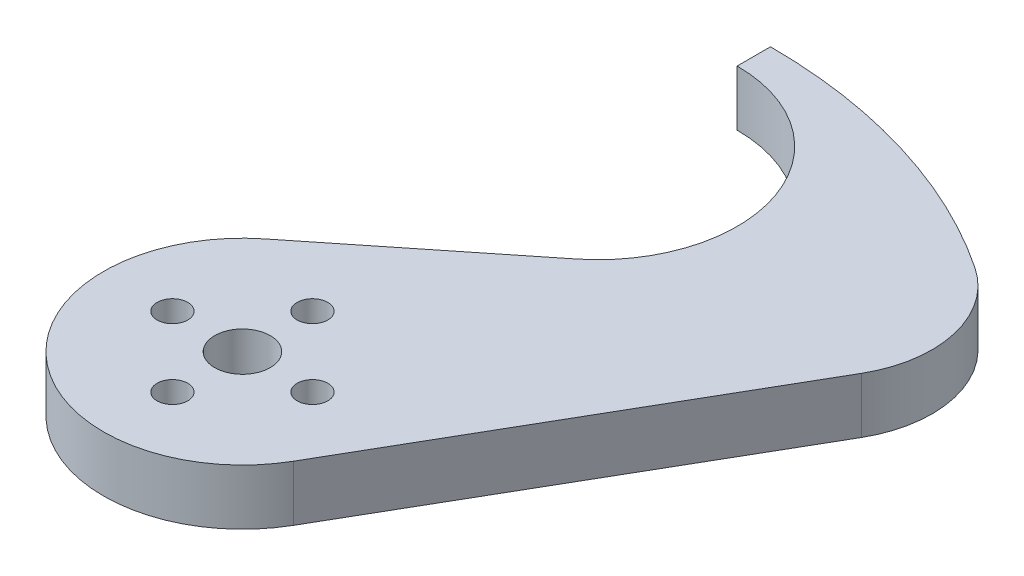
ISO-10303-21;
HEADER;
FILE_DESCRIPTION(('STEP AP214'),'2;1');
FILE_NAME('part.step','',(''),(''),'','','');
FILE_SCHEMA(('AUTOMOTIVE_DESIGN { 1 0 10303 214 1 1 1 1 }'));
ENDSEC;
DATA;
#1=APPLICATION_CONTEXT('core data for automotive mechanical design processes');
#2=APPLICATION_PROTOCOL_DEFINITION('international standard','automotive_design',2000,#1);
#3=PRODUCT_CONTEXT('',#1,'mechanical');
#4=PRODUCT('Part','Part','',(#3));
#5=PRODUCT_RELATED_PRODUCT_CATEGORY('part','',(#4));
#6=PRODUCT_DEFINITION_FORMATION('','',#4);
#7=PRODUCT_DEFINITION_CONTEXT('part definition',#1,'design');
#8=PRODUCT_DEFINITION('design','',#6,#7);
#9=PRODUCT_DEFINITION_SHAPE('','',#8);
#10=(LENGTH_UNIT() NAMED_UNIT(*) SI_UNIT(.MILLI.,.METRE.));
#11=(NAMED_UNIT(*) PLANE_ANGLE_UNIT() SI_UNIT($,.RADIAN.));
#12=(NAMED_UNIT(*) SI_UNIT($,.STERADIAN.) SOLID_ANGLE_UNIT());
#13=UNCERTAINTY_MEASURE_WITH_UNIT(LENGTH_MEASURE(1.E-05),#10,'distance_accuracy_value','');
#14=(GEOMETRIC_REPRESENTATION_CONTEXT(3) GLOBAL_UNCERTAINTY_ASSIGNED_CONTEXT((#13)) GLOBAL_UNIT_ASSIGNED_CONTEXT((#10,
#11,#12)) REPRESENTATION_CONTEXT('',''));
#15=CARTESIAN_POINT('',(0.,0.,0.));
#16=DIRECTION('',(0.,0.,1.));
#17=DIRECTION('',(1.,0.,0.));
#18=AXIS2_PLACEMENT_3D('',#15,#16,#17);
#19=CARTESIAN_POINT('',(0.,6.35,0.));
#20=DIRECTION('',(0.,-1.,0.));
#21=DIRECTION('',(0.,0.,-1.));
#22=AXIS2_PLACEMENT_3D('',#19,#20,#21);
#23=PLANE('',#22);
#24=CARTESIAN_POINT('',(0.,6.35,-8.));
#25=DIRECTION('',(0.,1.,0.));
#26=DIRECTION('',(1.,0.,0.));
#27=AXIS2_PLACEMENT_3D('',#24,#25,#26);
#28=CIRCLE('',#27,1.75);
#29=CARTESIAN_POINT('',(1.75000000000008,6.35,-7.99999999999998));
#30=VERTEX_POINT('',#29);
#31=EDGE_CURVE('E171',#30,#30,#28,.T.);
#32=ORIENTED_EDGE('',*,*,#31,.F.);
#33=EDGE_LOOP('',(#32));
#34=FACE_BOUND('',#33,.T.);
#35=CARTESIAN_POINT('',(-8.,6.35,0.));
#36=DIRECTION('',(0.,1.,0.));
#37=DIRECTION('',(0.,0.,-1.));
#38=AXIS2_PLACEMENT_3D('',#35,#36,#37);
#39=CIRCLE('',#38,1.75);
#40=CARTESIAN_POINT('',(-8.,6.35,-1.75));
#41=VERTEX_POINT('',#40);
#42=EDGE_CURVE('E165',#41,#41,#39,.T.);
#43=ORIENTED_EDGE('',*,*,#42,.F.);
#44=EDGE_LOOP('',(#43));
#45=FACE_BOUND('',#44,.T.);
#46=CARTESIAN_POINT('',(0.,6.35,8.));
#47=DIRECTION('',(0.,1.,0.));
#48=DIRECTION('',(-1.,0.,0.));
#49=AXIS2_PLACEMENT_3D('',#46,#47,#48);
#50=CIRCLE('',#49,1.75);
#51=CARTESIAN_POINT('',(-1.75000000000003,6.35,7.99999999999999));
#52=VERTEX_POINT('',#51);
#53=EDGE_CURVE('E159',#52,#52,#50,.T.);
#54=ORIENTED_EDGE('',*,*,#53,.F.);
#55=EDGE_LOOP('',(#54));
#56=FACE_BOUND('',#55,.T.);
#57=CARTESIAN_POINT('',(8.,6.35,0.));
#58=DIRECTION('',(0.,1.,0.));
#59=DIRECTION('',(0.,0.,1.));
#60=AXIS2_PLACEMENT_3D('',#57,#58,#59);
#61=CIRCLE('',#60,1.75);
#62=CARTESIAN_POINT('',(8.,6.35,1.75));
#63=VERTEX_POINT('',#62);
#64=EDGE_CURVE('E153',#63,#63,#61,.T.);
#65=ORIENTED_EDGE('',*,*,#64,.F.);
#66=EDGE_LOOP('',(#65));
#67=FACE_BOUND('',#66,.T.);
#68=DIRECTION('',(0.499999999999995,0.,-0.866025403784442));
#69=VECTOR('',#68,1.);
#70=CARTESIAN_POINT('',(13.748153285078,6.35,7.93749999999991));
#71=LINE('',#70,#69);
#72=CARTESIAN_POINT('',(13.748153285078,6.35,7.93749999999992));
#73=VERTEX_POINT('',#72);
#74=CARTESIAN_POINT('',(37.5076776910923,6.35,-33.2152034348901));
#75=VERTEX_POINT('',#74);
#76=EDGE_CURVE('E129',#73,#75,#71,.T.);
#77=ORIENTED_EDGE('',*,*,#76,.T.);
#78=CARTESIAN_POINT('',(26.5091550630299,6.35,-39.5652034348901));
#79=DIRECTION('',(0.,-1.,0.));
#80=DIRECTION('',(0.,0.,-1.));
#81=AXIS2_PLACEMENT_3D('',#78,#79,#80);
#82=CIRCLE('',#81,12.7);
#83=CARTESIAN_POINT('',(33.5782630798378,6.35,-50.1159243508608));
#84=VERTEX_POINT('',#83);
#85=EDGE_CURVE('E11',#75,#84,#82,.F.);
#86=ORIENTED_EDGE('',*,*,#85,.T.);
#87=CARTESIAN_POINT('',(0.,6.35,0.));
#88=DIRECTION('',(0.,1.,0.));
#89=DIRECTION('',(0.,0.,-1.));
#90=AXIS2_PLACEMENT_3D('',#87,#88,#89);
#91=CIRCLE('',#90,60.325);
#92=CARTESIAN_POINT('',(0.,6.35,-60.325));
#93=VERTEX_POINT('',#92);
#94=EDGE_CURVE('E90',#84,#93,#91,.T.);
#95=ORIENTED_EDGE('',*,*,#94,.T.);
#96=DIRECTION('',(0.,0.,1.));
#97=VECTOR('',#96,1.);
#98=CARTESIAN_POINT('',(0.,6.35,-60.325));
#99=LINE('',#98,#97);
#100=CARTESIAN_POINT('',(0.,6.35,-56.515));
#101=VERTEX_POINT('',#100);
#102=EDGE_CURVE('E93',#93,#101,#99,.T.);
#103=ORIENTED_EDGE('',*,*,#102,.T.);
#104=CARTESIAN_POINT('',(0.,6.35,-40.64));
#105=DIRECTION('',(0.,-1.,0.));
#106=DIRECTION('',(0.,0.,-1.));
#107=AXIS2_PLACEMENT_3D('',#104,#105,#106);
#108=CIRCLE('',#107,15.875);
#109=CARTESIAN_POINT('',(9.90946489508066,6.35,-28.23765625));
#110=VERTEX_POINT('',#109);
#111=EDGE_CURVE('E109',#101,#110,#108,.T.);
#112=ORIENTED_EDGE('',*,*,#111,.T.);
#113=DIRECTION('',(-0.78125,0.,0.624218261107443));
#114=VECTOR('',#113,1.);
#115=CARTESIAN_POINT('',(9.90946489508066,6.35,-28.23765625));
#116=LINE('',#115,#114);
#117=CARTESIAN_POINT('',(-9.90946489508066,6.35,-12.40234375));
#118=VERTEX_POINT('',#117);
#119=EDGE_CURVE('E144',#110,#118,#116,.T.);
#120=ORIENTED_EDGE('',*,*,#119,.T.);
#121=CARTESIAN_POINT('',(0.,6.35,0.));
#122=DIRECTION('',(0.,1.,0.));
#123=DIRECTION('',(0.,0.,1.));
#124=AXIS2_PLACEMENT_3D('',#121,#122,#123);
#125=CIRCLE('',#124,15.875);
#126=EDGE_CURVE('E142',#118,#73,#125,.T.);
#127=ORIENTED_EDGE('',*,*,#126,.T.);
#128=EDGE_LOOP('',(#77,#86,#95,#103,#112,#120,#127));
#129=FACE_BOUND('',#128,.T.);
#130=CARTESIAN_POINT('',(0.,6.35,0.));
#131=DIRECTION('',(0.,1.,0.));
#132=DIRECTION('',(0.,0.,1.));
#133=AXIS2_PLACEMENT_3D('',#130,#131,#132);
#134=CIRCLE('',#133,3.175);
#135=CARTESIAN_POINT('',(0.,6.35,3.175));
#136=VERTEX_POINT('',#135);
#137=EDGE_CURVE('E140',#136,#136,#134,.T.);
#138=ORIENTED_EDGE('',*,*,#137,.F.);
#139=EDGE_LOOP('',(#138));
#140=FACE_BOUND('',#139,.T.);
#141=ADVANCED_FACE('F32',(#34,#45,#56,#67,#129,#140),#23,.F.);
#142=CARTESIAN_POINT('',(0.,0.,0.));
#143=DIRECTION('',(0.,-1.,0.));
#144=DIRECTION('',(0.,0.,-1.));
#145=AXIS2_PLACEMENT_3D('',#142,#143,#144);
#146=PLANE('',#145);
#147=CARTESIAN_POINT('',(0.,0.,-8.));
#148=DIRECTION('',(0.,1.,0.));
#149=DIRECTION('',(1.,0.,0.));
#150=AXIS2_PLACEMENT_3D('',#147,#148,#149);
#151=CIRCLE('',#150,1.75);
#152=CARTESIAN_POINT('',(1.75000000000008,0.,-7.99999999999998));
#153=VERTEX_POINT('',#152);
#154=EDGE_CURVE('E168',#153,#153,#151,.T.);
#155=ORIENTED_EDGE('',*,*,#154,.T.);
#156=EDGE_LOOP('',(#155));
#157=FACE_BOUND('',#156,.T.);
#158=CARTESIAN_POINT('',(-8.,0.,0.));
#159=DIRECTION('',(0.,1.,0.));
#160=DIRECTION('',(0.,0.,-1.));
#161=AXIS2_PLACEMENT_3D('',#158,#159,#160);
#162=CIRCLE('',#161,1.75);
#163=CARTESIAN_POINT('',(-8.,0.,-1.75));
#164=VERTEX_POINT('',#163);
#165=EDGE_CURVE('E162',#164,#164,#162,.T.);
#166=ORIENTED_EDGE('',*,*,#165,.T.);
#167=EDGE_LOOP('',(#166));
#168=FACE_BOUND('',#167,.T.);
#169=CARTESIAN_POINT('',(0.,0.,8.));
#170=DIRECTION('',(0.,1.,0.));
#171=DIRECTION('',(-1.,0.,0.));
#172=AXIS2_PLACEMENT_3D('',#169,#170,#171);
#173=CIRCLE('',#172,1.75);
#174=CARTESIAN_POINT('',(-1.75000000000003,0.,7.99999999999999));
#175=VERTEX_POINT('',#174);
#176=EDGE_CURVE('E156',#175,#175,#173,.T.);
#177=ORIENTED_EDGE('',*,*,#176,.T.);
#178=EDGE_LOOP('',(#177));
#179=FACE_BOUND('',#178,.T.);
#180=CARTESIAN_POINT('',(8.,0.,0.));
#181=DIRECTION('',(0.,1.,0.));
#182=DIRECTION('',(0.,0.,1.));
#183=AXIS2_PLACEMENT_3D('',#180,#181,#182);
#184=CIRCLE('',#183,1.75);
#185=CARTESIAN_POINT('',(8.,0.,1.75));
#186=VERTEX_POINT('',#185);
#187=EDGE_CURVE('E150',#186,#186,#184,.T.);
#188=ORIENTED_EDGE('',*,*,#187,.T.);
#189=EDGE_LOOP('',(#188));
#190=FACE_BOUND('',#189,.T.);
#191=CARTESIAN_POINT('',(0.,0.,0.));
#192=DIRECTION('',(0.,1.,0.));
#193=DIRECTION('',(0.,0.,-1.));
#194=AXIS2_PLACEMENT_3D('',#191,#192,#193);
#195=CIRCLE('',#194,60.325);
#196=CARTESIAN_POINT('',(33.5782630798378,0.,-50.1159243508608));
#197=VERTEX_POINT('',#196);
#198=CARTESIAN_POINT('',(0.,0.,-60.325));
#199=VERTEX_POINT('',#198);
#200=EDGE_CURVE('E112',#197,#199,#195,.T.);
#201=ORIENTED_EDGE('',*,*,#200,.F.);
#202=CARTESIAN_POINT('',(26.5091550630299,0.,-39.5652034348901));
#203=DIRECTION('',(0.,-1.,0.));
#204=DIRECTION('',(0.,0.,-1.));
#205=AXIS2_PLACEMENT_3D('',#202,#203,#204);
#206=CIRCLE('',#205,12.7);
#207=CARTESIAN_POINT('',(37.5076776910923,0.,-33.2152034348901));
#208=VERTEX_POINT('',#207);
#209=EDGE_CURVE('E54',#197,#208,#206,.T.);
#210=ORIENTED_EDGE('',*,*,#209,.T.);
#211=DIRECTION('',(0.499999999999995,0.,-0.866025403784442));
#212=VECTOR('',#211,1.);
#213=CARTESIAN_POINT('',(13.748153285078,0.,7.93749999999991));
#214=LINE('',#213,#212);
#215=CARTESIAN_POINT('',(13.748153285078,0.,7.93749999999992));
#216=VERTEX_POINT('',#215);
#217=EDGE_CURVE('E100',#216,#208,#214,.T.);
#218=ORIENTED_EDGE('',*,*,#217,.F.);
#219=CARTESIAN_POINT('',(0.,0.,0.));
#220=DIRECTION('',(0.,1.,0.));
#221=DIRECTION('',(0.,0.,1.));
#222=AXIS2_PLACEMENT_3D('',#219,#220,#221);
#223=CIRCLE('',#222,15.875);
#224=CARTESIAN_POINT('',(-9.90946489508066,0.,-12.40234375));
#225=VERTEX_POINT('',#224);
#226=EDGE_CURVE('E131',#225,#216,#223,.T.);
#227=ORIENTED_EDGE('',*,*,#226,.F.);
#228=DIRECTION('',(-0.78125,0.,0.624218261107443));
#229=VECTOR('',#228,1.);
#230=CARTESIAN_POINT('',(9.90946489508066,0.,-28.23765625));
#231=LINE('',#230,#229);
#232=CARTESIAN_POINT('',(9.90946489508066,0.,-28.23765625));
#233=VERTEX_POINT('',#232);
#234=EDGE_CURVE('E133',#233,#225,#231,.T.);
#235=ORIENTED_EDGE('',*,*,#234,.F.);
#236=CARTESIAN_POINT('',(0.,0.,-40.64));
#237=DIRECTION('',(0.,-1.,0.));
#238=DIRECTION('',(0.,0.,-1.));
#239=AXIS2_PLACEMENT_3D('',#236,#237,#238);
#240=CIRCLE('',#239,15.875);
#241=CARTESIAN_POINT('',(0.,0.,-56.515));
#242=VERTEX_POINT('',#241);
#243=EDGE_CURVE('E135',#242,#233,#240,.T.);
#244=ORIENTED_EDGE('',*,*,#243,.F.);
#245=DIRECTION('',(0.,0.,1.));
#246=VECTOR('',#245,1.);
#247=CARTESIAN_POINT('',(0.,0.,-60.325));
#248=LINE('',#247,#246);
#249=EDGE_CURVE('E137',#199,#242,#248,.T.);
#250=ORIENTED_EDGE('',*,*,#249,.F.);
#251=EDGE_LOOP('',(#201,#210,#218,#227,#235,#244,#250));
#252=FACE_BOUND('',#251,.T.);
#253=CARTESIAN_POINT('',(0.,0.,0.));
#254=DIRECTION('',(0.,1.,0.));
#255=DIRECTION('',(0.,0.,1.));
#256=AXIS2_PLACEMENT_3D('',#253,#254,#255);
#257=CIRCLE('',#256,3.175);
#258=CARTESIAN_POINT('',(0.,0.,3.175));
#259=VERTEX_POINT('',#258);
#260=EDGE_CURVE('E147',#259,#259,#257,.T.);
#261=ORIENTED_EDGE('',*,*,#260,.T.);
#262=EDGE_LOOP('',(#261));
#263=FACE_BOUND('',#262,.T.);
#264=ADVANCED_FACE('F177',(#157,#168,#179,#190,#252,#263),#146,.T.);
#265=CARTESIAN_POINT('',(0.,6.35,0.));
#266=DIRECTION('',(0.,-1.,0.));
#267=DIRECTION('',(0.,0.,-1.));
#268=AXIS2_PLACEMENT_3D('',#265,#266,#267);
#269=CYLINDRICAL_SURFACE('',#268,60.325);
#270=ORIENTED_EDGE('',*,*,#94,.F.);
#271=DIRECTION('',(0.,-1.,0.));
#272=VECTOR('',#271,1.);
#273=CARTESIAN_POINT('',(33.5782630798378,6.35,-50.1159243508608));
#274=LINE('',#273,#272);
#275=EDGE_CURVE('E114',#84,#197,#274,.T.);
#276=ORIENTED_EDGE('',*,*,#275,.T.);
#277=ORIENTED_EDGE('',*,*,#200,.T.);
#278=DIRECTION('',(0.,-1.,0.));
#279=VECTOR('',#278,1.);
#280=CARTESIAN_POINT('',(0.,6.35,-60.325));
#281=LINE('',#280,#279);
#282=EDGE_CURVE('E105',#93,#199,#281,.T.);
#283=ORIENTED_EDGE('',*,*,#282,.F.);
#284=EDGE_LOOP('',(#270,#276,#277,#283));
#285=FACE_BOUND('',#284,.T.);
#286=ADVANCED_FACE('F111',(#285),#269,.T.);
#287=CARTESIAN_POINT('',(0.,6.35,-60.325));
#288=DIRECTION('',(1.,0.,0.));
#289=DIRECTION('',(0.,0.,-1.));
#290=AXIS2_PLACEMENT_3D('',#287,#288,#289);
#291=PLANE('',#290);
#292=ORIENTED_EDGE('',*,*,#249,.T.);
#293=DIRECTION('',(0.,-1.,0.));
#294=VECTOR('',#293,1.);
#295=CARTESIAN_POINT('',(0.,6.35,-56.515));
#296=LINE('',#295,#294);
#297=EDGE_CURVE('E107',#101,#242,#296,.T.);
#298=ORIENTED_EDGE('',*,*,#297,.F.);
#299=ORIENTED_EDGE('',*,*,#102,.F.);
#300=ORIENTED_EDGE('',*,*,#282,.T.);
#301=EDGE_LOOP('',(#292,#298,#299,#300));
#302=FACE_BOUND('',#301,.T.);
#303=ADVANCED_FACE('F104',(#302),#291,.F.);
#304=CARTESIAN_POINT('',(0.,6.35,-40.64));
#305=DIRECTION('',(0.,-1.,0.));
#306=DIRECTION('',(0.,0.,-1.));
#307=AXIS2_PLACEMENT_3D('',#304,#305,#306);
#308=CYLINDRICAL_SURFACE('',#307,15.875);
#309=ORIENTED_EDGE('',*,*,#243,.T.);
#310=DIRECTION('',(0.,-1.,0.));
#311=VECTOR('',#310,1.);
#312=CARTESIAN_POINT('',(9.90946489508066,6.35,-28.23765625));
#313=LINE('',#312,#311);
#314=EDGE_CURVE('E117',#110,#233,#313,.T.);
#315=ORIENTED_EDGE('',*,*,#314,.F.);
#316=ORIENTED_EDGE('',*,*,#111,.F.);
#317=ORIENTED_EDGE('',*,*,#297,.T.);
#318=EDGE_LOOP('',(#309,#315,#316,#317));
#319=FACE_BOUND('',#318,.T.);
#320=ADVANCED_FACE('F225',(#319),#308,.F.);
#321=CARTESIAN_POINT('',(9.90946489508066,6.35,-28.23765625));
#322=DIRECTION('',(0.624218261107443,0.,0.78125));
#323=DIRECTION('',(0.78125,0.,-0.624218261107443));
#324=AXIS2_PLACEMENT_3D('',#321,#322,#323);
#325=PLANE('',#324);
#326=ORIENTED_EDGE('',*,*,#234,.T.);
#327=DIRECTION('',(0.,-1.,0.));
#328=VECTOR('',#327,1.);
#329=CARTESIAN_POINT('',(-9.90946489508066,6.35,-12.40234375));
#330=LINE('',#329,#328);
#331=EDGE_CURVE('E123',#118,#225,#330,.T.);
#332=ORIENTED_EDGE('',*,*,#331,.F.);
#333=ORIENTED_EDGE('',*,*,#119,.F.);
#334=ORIENTED_EDGE('',*,*,#314,.T.);
#335=EDGE_LOOP('',(#326,#332,#333,#334));
#336=FACE_BOUND('',#335,.T.);
#337=ADVANCED_FACE('F221',(#336),#325,.F.);
#338=CARTESIAN_POINT('',(0.,6.35,0.));
#339=DIRECTION('',(0.,-1.,0.));
#340=DIRECTION('',(0.,0.,-1.));
#341=AXIS2_PLACEMENT_3D('',#338,#339,#340);
#342=CYLINDRICAL_SURFACE('',#341,15.875);
#343=ORIENTED_EDGE('',*,*,#226,.T.);
#344=DIRECTION('',(0.,-1.,0.));
#345=VECTOR('',#344,1.);
#346=CARTESIAN_POINT('',(13.748153285078,6.35,7.93749999999992));
#347=LINE('',#346,#345);
#348=EDGE_CURVE('E126',#73,#216,#347,.T.);
#349=ORIENTED_EDGE('',*,*,#348,.F.);
#350=ORIENTED_EDGE('',*,*,#126,.F.);
#351=ORIENTED_EDGE('',*,*,#331,.T.);
#352=EDGE_LOOP('',(#343,#349,#350,#351));
#353=FACE_BOUND('',#352,.T.);
#354=ADVANCED_FACE('F218',(#353),#342,.T.);
#355=CARTESIAN_POINT('',(13.748153285078,6.35,7.93749999999991));
#356=DIRECTION('',(-0.866025403784442,0.,-0.499999999999995));
#357=DIRECTION('',(-0.499999999999995,0.,0.866025403784442));
#358=AXIS2_PLACEMENT_3D('',#355,#356,#357);
#359=PLANE('',#358);
#360=ORIENTED_EDGE('',*,*,#217,.T.);
#361=DIRECTION('',(0.,-1.,0.));
#362=VECTOR('',#361,1.);
#363=CARTESIAN_POINT('',(37.5076776910923,6.35,-33.2152034348901));
#364=LINE('',#363,#362);
#365=EDGE_CURVE('E40',#208,#75,#364,.F.);
#366=ORIENTED_EDGE('',*,*,#365,.T.);
#367=ORIENTED_EDGE('',*,*,#76,.F.);
#368=ORIENTED_EDGE('',*,*,#348,.T.);
#369=EDGE_LOOP('',(#360,#366,#367,#368));
#370=FACE_BOUND('',#369,.T.);
#371=ADVANCED_FACE('F208',(#370),#359,.F.);
#372=CARTESIAN_POINT('',(0.,6.35,0.));
#373=DIRECTION('',(0.,-1.,0.));
#374=DIRECTION('',(0.,0.,-1.));
#375=AXIS2_PLACEMENT_3D('',#372,#373,#374);
#376=CYLINDRICAL_SURFACE('',#375,3.175);
#377=ORIENTED_EDGE('',*,*,#137,.T.);
#378=EDGE_LOOP('',(#377));
#379=FACE_BOUND('',#378,.T.);
#380=ORIENTED_EDGE('',*,*,#260,.F.);
#381=EDGE_LOOP('',(#380));
#382=FACE_BOUND('',#381,.T.);
#383=ADVANCED_FACE('F199',(#379,#382),#376,.F.);
#384=CARTESIAN_POINT('',(8.,0.,0.));
#385=DIRECTION('',(0.,1.,0.));
#386=DIRECTION('',(0.,0.,1.));
#387=AXIS2_PLACEMENT_3D('',#384,#385,#386);
#388=CYLINDRICAL_SURFACE('',#387,1.75);
#389=ORIENTED_EDGE('',*,*,#187,.F.);
#390=EDGE_LOOP('',(#389));
#391=FACE_BOUND('',#390,.T.);
#392=ORIENTED_EDGE('',*,*,#64,.T.);
#393=EDGE_LOOP('',(#392));
#394=FACE_BOUND('',#393,.T.);
#395=ADVANCED_FACE('F196',(#391,#394),#388,.F.);
#396=CARTESIAN_POINT('',(0.,0.,8.));
#397=DIRECTION('',(0.,1.,0.));
#398=DIRECTION('',(0.,0.,1.));
#399=AXIS2_PLACEMENT_3D('',#396,#397,#398);
#400=CYLINDRICAL_SURFACE('',#399,1.75);
#401=ORIENTED_EDGE('',*,*,#176,.F.);
#402=EDGE_LOOP('',(#401));
#403=FACE_BOUND('',#402,.T.);
#404=ORIENTED_EDGE('',*,*,#53,.T.);
#405=EDGE_LOOP('',(#404));
#406=FACE_BOUND('',#405,.T.);
#407=ADVANCED_FACE('F198',(#403,#406),#400,.F.);
#408=CARTESIAN_POINT('',(-8.,0.,0.));
#409=DIRECTION('',(0.,1.,0.));
#410=DIRECTION('',(0.,0.,1.));
#411=AXIS2_PLACEMENT_3D('',#408,#409,#410);
#412=CYLINDRICAL_SURFACE('',#411,1.75);
#413=ORIENTED_EDGE('',*,*,#165,.F.);
#414=EDGE_LOOP('',(#413));
#415=FACE_BOUND('',#414,.T.);
#416=ORIENTED_EDGE('',*,*,#42,.T.);
#417=EDGE_LOOP('',(#416));
#418=FACE_BOUND('',#417,.T.);
#419=ADVANCED_FACE('F183',(#415,#418),#412,.F.);
#420=CARTESIAN_POINT('',(0.,0.,-8.));
#421=DIRECTION('',(0.,1.,0.));
#422=DIRECTION('',(0.,0.,1.));
#423=AXIS2_PLACEMENT_3D('',#420,#421,#422);
#424=CYLINDRICAL_SURFACE('',#423,1.75);
#425=ORIENTED_EDGE('',*,*,#154,.F.);
#426=EDGE_LOOP('',(#425));
#427=FACE_BOUND('',#426,.T.);
#428=ORIENTED_EDGE('',*,*,#31,.T.);
#429=EDGE_LOOP('',(#428));
#430=FACE_BOUND('',#429,.T.);
#431=ADVANCED_FACE('F180',(#427,#430),#424,.F.);
#432=CARTESIAN_POINT('',(26.5091550630299,6.35,-39.5652034348901));
#433=DIRECTION('',(0.,-1.,0.));
#434=DIRECTION('',(0.,0.,-1.));
#435=AXIS2_PLACEMENT_3D('',#432,#433,#434);
#436=CYLINDRICAL_SURFACE('',#435,12.7);
#437=ORIENTED_EDGE('',*,*,#85,.F.);
#438=ORIENTED_EDGE('',*,*,#365,.F.);
#439=ORIENTED_EDGE('',*,*,#209,.F.);
#440=ORIENTED_EDGE('',*,*,#275,.F.);
#441=EDGE_LOOP('',(#437,#438,#439,#440));
#442=FACE_BOUND('',#441,.T.);
#443=ADVANCED_FACE('F34',(#442),#436,.T.);
#444=CLOSED_SHELL('',(#141,#264,#286,#303,#320,#337,#354,#371,#383,#395,#407,#419,#431,#443));
#445=MANIFOLD_SOLID_BREP('B2',#444);
#446=ADVANCED_BREP_SHAPE_REPRESENTATION('',(#18,#445),#14);
#447=SHAPE_DEFINITION_REPRESENTATION(#9,#446);
ENDSEC;
END-ISO-10303-21;
